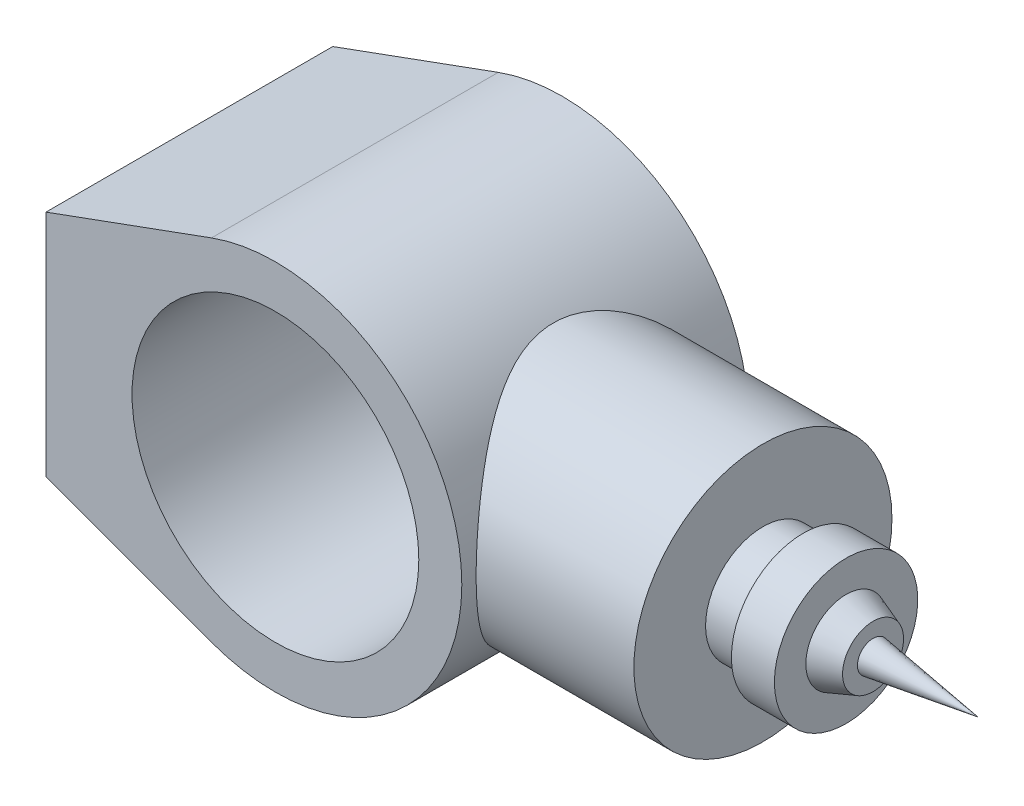
ISO-10303-21;
HEADER;
FILE_DESCRIPTION(('STEP AP214'),'2;1');
FILE_NAME('part.step','',(''),(''),'','','');
FILE_SCHEMA(('AUTOMOTIVE_DESIGN { 1 0 10303 214 1 1 1 1 }'));
ENDSEC;
DATA;
#1=APPLICATION_CONTEXT('core data for automotive mechanical design processes');
#2=APPLICATION_PROTOCOL_DEFINITION('international standard','automotive_design',2000,#1);
#3=PRODUCT_CONTEXT('',#1,'mechanical');
#4=PRODUCT('Part','Part','',(#3));
#5=PRODUCT_RELATED_PRODUCT_CATEGORY('part','',(#4));
#6=PRODUCT_DEFINITION_FORMATION('','',#4);
#7=PRODUCT_DEFINITION_CONTEXT('part definition',#1,'design');
#8=PRODUCT_DEFINITION('design','',#6,#7);
#9=PRODUCT_DEFINITION_SHAPE('','',#8);
#10=(LENGTH_UNIT() NAMED_UNIT(*) SI_UNIT(.MILLI.,.METRE.));
#11=(NAMED_UNIT(*) PLANE_ANGLE_UNIT() SI_UNIT($,.RADIAN.));
#12=(NAMED_UNIT(*) SI_UNIT($,.STERADIAN.) SOLID_ANGLE_UNIT());
#13=UNCERTAINTY_MEASURE_WITH_UNIT(LENGTH_MEASURE(1.E-05),#10,'distance_accuracy_value','');
#14=(GEOMETRIC_REPRESENTATION_CONTEXT(3) GLOBAL_UNCERTAINTY_ASSIGNED_CONTEXT((#13)) GLOBAL_UNIT_ASSIGNED_CONTEXT((#10,
#11,#12)) REPRESENTATION_CONTEXT('',''));
#15=CARTESIAN_POINT('',(0.,0.,0.));
#16=DIRECTION('',(0.,0.,1.));
#17=DIRECTION('',(1.,0.,0.));
#18=AXIS2_PLACEMENT_3D('',#15,#16,#17);
#19=CARTESIAN_POINT('',(0.,0.,100.));
#20=DIRECTION('',(0.,0.,1.));
#21=DIRECTION('',(1.,0.,0.));
#22=AXIS2_PLACEMENT_3D('',#19,#20,#21);
#23=PLANE('',#22);
#24=DIRECTION('',(-0.939410286372225,-0.342794856813887,0.));
#25=VECTOR('',#24,1.);
#26=CARTESIAN_POINT('',(-80.,40.,100.));
#27=LINE('',#26,#25);
#28=CARTESIAN_POINT('',(-22.2816656929027,61.0616686141947,100.));
#29=VERTEX_POINT('',#28);
#30=CARTESIAN_POINT('',(-80.,40.,100.));
#31=VERTEX_POINT('',#30);
#32=EDGE_CURVE('E180',#29,#31,#27,.T.);
#33=ORIENTED_EDGE('',*,*,#32,.T.);
#34=DIRECTION('',(0.,-1.,0.));
#35=VECTOR('',#34,1.);
#36=CARTESIAN_POINT('',(-80.,-40.,100.));
#37=LINE('',#36,#35);
#38=CARTESIAN_POINT('',(-80.,-40.,100.));
#39=VERTEX_POINT('',#38);
#40=EDGE_CURVE('E82',#31,#39,#37,.T.);
#41=ORIENTED_EDGE('',*,*,#40,.T.);
#42=DIRECTION('',(0.939410286372225,-0.342794856813887,0.));
#43=VECTOR('',#42,1.);
#44=CARTESIAN_POINT('',(-80.,-40.,100.));
#45=LINE('',#44,#43);
#46=CARTESIAN_POINT('',(-22.2816656929027,-61.0616686141947,100.));
#47=VERTEX_POINT('',#46);
#48=EDGE_CURVE('E176',#39,#47,#45,.T.);
#49=ORIENTED_EDGE('',*,*,#48,.T.);
#50=CARTESIAN_POINT('',(0.,0.,100.));
#51=DIRECTION('',(0.,0.,1.));
#52=DIRECTION('',(1.,0.,0.));
#53=AXIS2_PLACEMENT_3D('',#50,#51,#52);
#54=CIRCLE('',#53,65.);
#55=EDGE_CURVE('E51',#47,#29,#54,.T.);
#56=ORIENTED_EDGE('',*,*,#55,.T.);
#57=EDGE_LOOP('',(#33,#41,#49,#56));
#58=FACE_BOUND('',#57,.T.);
#59=CARTESIAN_POINT('',(0.,0.,100.));
#60=DIRECTION('',(0.,0.,1.));
#61=DIRECTION('',(1.,0.,0.));
#62=AXIS2_PLACEMENT_3D('',#59,#60,#61);
#63=CIRCLE('',#62,50.);
#64=CARTESIAN_POINT('',(50.,0.,100.));
#65=VERTEX_POINT('',#64);
#66=EDGE_CURVE('E190',#65,#65,#63,.T.);
#67=ORIENTED_EDGE('',*,*,#66,.F.);
#68=EDGE_LOOP('',(#67));
#69=FACE_BOUND('',#68,.T.);
#70=ADVANCED_FACE('F34',(#58,#69),#23,.T.);
#71=CARTESIAN_POINT('',(0.,0.,0.));
#72=DIRECTION('',(0.,0.,1.));
#73=DIRECTION('',(1.,0.,0.));
#74=AXIS2_PLACEMENT_3D('',#71,#72,#73);
#75=PLANE('',#74);
#76=DIRECTION('',(-0.939410286372225,-0.342794856813887,0.));
#77=VECTOR('',#76,1.);
#78=CARTESIAN_POINT('',(-80.,40.,0.));
#79=LINE('',#78,#77);
#80=CARTESIAN_POINT('',(-22.2816656929027,61.0616686141947,0.));
#81=VERTEX_POINT('',#80);
#82=CARTESIAN_POINT('',(-80.,40.,0.));
#83=VERTEX_POINT('',#82);
#84=EDGE_CURVE('E174',#81,#83,#79,.T.);
#85=ORIENTED_EDGE('',*,*,#84,.F.);
#86=CARTESIAN_POINT('',(0.,0.,0.));
#87=DIRECTION('',(0.,0.,1.));
#88=DIRECTION('',(1.,0.,0.));
#89=AXIS2_PLACEMENT_3D('',#86,#87,#88);
#90=CIRCLE('',#89,65.);
#91=CARTESIAN_POINT('',(-22.2816656929027,-61.0616686141947,0.));
#92=VERTEX_POINT('',#91);
#93=EDGE_CURVE('E75',#92,#81,#90,.T.);
#94=ORIENTED_EDGE('',*,*,#93,.F.);
#95=DIRECTION('',(0.939410286372225,-0.342794856813887,0.));
#96=VECTOR('',#95,1.);
#97=CARTESIAN_POINT('',(-80.,-40.,0.));
#98=LINE('',#97,#96);
#99=CARTESIAN_POINT('',(-80.,-40.,0.));
#100=VERTEX_POINT('',#99);
#101=EDGE_CURVE('E69',#100,#92,#98,.T.);
#102=ORIENTED_EDGE('',*,*,#101,.F.);
#103=DIRECTION('',(0.,-1.,0.));
#104=VECTOR('',#103,1.);
#105=CARTESIAN_POINT('',(-80.,-40.,0.));
#106=LINE('',#105,#104);
#107=EDGE_CURVE('E169',#83,#100,#106,.T.);
#108=ORIENTED_EDGE('',*,*,#107,.F.);
#109=EDGE_LOOP('',(#85,#94,#102,#108));
#110=FACE_BOUND('',#109,.T.);
#111=CARTESIAN_POINT('',(0.,0.,0.));
#112=DIRECTION('',(0.,0.,1.));
#113=DIRECTION('',(1.,0.,0.));
#114=AXIS2_PLACEMENT_3D('',#111,#112,#113);
#115=CIRCLE('',#114,50.);
#116=CARTESIAN_POINT('',(50.,0.,0.));
#117=VERTEX_POINT('',#116);
#118=EDGE_CURVE('E192',#117,#117,#115,.T.);
#119=ORIENTED_EDGE('',*,*,#118,.T.);
#120=EDGE_LOOP('',(#119));
#121=FACE_BOUND('',#120,.T.);
#122=ADVANCED_FACE('F149',(#110,#121),#75,.F.);
#123=CARTESIAN_POINT('',(-80.,40.,100.));
#124=DIRECTION('',(0.342794856813887,-0.939410286372225,0.));
#125=DIRECTION('',(0.939410286372225,0.342794856813887,0.));
#126=AXIS2_PLACEMENT_3D('',#123,#124,#125);
#127=PLANE('',#126);
#128=ORIENTED_EDGE('',*,*,#84,.T.);
#129=DIRECTION('',(0.,0.,-1.));
#130=VECTOR('',#129,1.);
#131=CARTESIAN_POINT('',(-80.,40.,100.));
#132=LINE('',#131,#130);
#133=EDGE_CURVE('E11',#31,#83,#132,.T.);
#134=ORIENTED_EDGE('',*,*,#133,.F.);
#135=ORIENTED_EDGE('',*,*,#32,.F.);
#136=DIRECTION('',(0.,0.,-1.));
#137=VECTOR('',#136,1.);
#138=CARTESIAN_POINT('',(-22.2816656929027,61.0616686141947,100.));
#139=LINE('',#138,#137);
#140=EDGE_CURVE('E184',#29,#81,#139,.T.);
#141=ORIENTED_EDGE('',*,*,#140,.T.);
#142=EDGE_LOOP('',(#128,#134,#135,#141));
#143=FACE_BOUND('',#142,.T.);
#144=ADVANCED_FACE('F36',(#143),#127,.F.);
#145=CARTESIAN_POINT('',(-80.,-40.,100.));
#146=DIRECTION('',(1.,0.,0.));
#147=DIRECTION('',(0.,0.,-1.));
#148=AXIS2_PLACEMENT_3D('',#145,#146,#147);
#149=PLANE('',#148);
#150=ORIENTED_EDGE('',*,*,#107,.T.);
#151=DIRECTION('',(0.,0.,-1.));
#152=VECTOR('',#151,1.);
#153=CARTESIAN_POINT('',(-80.,-40.,100.));
#154=LINE('',#153,#152);
#155=EDGE_CURVE('E43',#39,#100,#154,.T.);
#156=ORIENTED_EDGE('',*,*,#155,.F.);
#157=ORIENTED_EDGE('',*,*,#40,.F.);
#158=ORIENTED_EDGE('',*,*,#133,.T.);
#159=EDGE_LOOP('',(#150,#156,#157,#158));
#160=FACE_BOUND('',#159,.T.);
#161=ADVANCED_FACE('F163',(#160),#149,.F.);
#162=CARTESIAN_POINT('',(-80.,-40.,100.));
#163=DIRECTION('',(0.342794856813887,0.939410286372225,0.));
#164=DIRECTION('',(-0.939410286372225,0.342794856813887,0.));
#165=AXIS2_PLACEMENT_3D('',#162,#163,#164);
#166=PLANE('',#165);
#167=ORIENTED_EDGE('',*,*,#101,.T.);
#168=DIRECTION('',(0.,0.,-1.));
#169=VECTOR('',#168,1.);
#170=CARTESIAN_POINT('',(-22.2816656929027,-61.0616686141947,100.));
#171=LINE('',#170,#169);
#172=EDGE_CURVE('E177',#47,#92,#171,.T.);
#173=ORIENTED_EDGE('',*,*,#172,.F.);
#174=ORIENTED_EDGE('',*,*,#48,.F.);
#175=ORIENTED_EDGE('',*,*,#155,.T.);
#176=EDGE_LOOP('',(#167,#173,#174,#175));
#177=FACE_BOUND('',#176,.T.);
#178=ADVANCED_FACE('F160',(#177),#166,.F.);
#179=CARTESIAN_POINT('',(0.,0.,100.));
#180=DIRECTION('',(0.,0.,-1.));
#181=DIRECTION('',(-1.,0.,0.));
#182=AXIS2_PLACEMENT_3D('',#179,#180,#181);
#183=CYLINDRICAL_SURFACE('',#182,65.);
#184=CARTESIAN_POINT('',(65.,0.,5.));
#185=CARTESIAN_POINT('',(65.0000011696057,1.12147330120565,4.99999879747171));
#186=CARTESIAN_POINT('',(64.9709159765212,2.24292945230778,5.04197983975179));
#187=CARTESIAN_POINT('',(64.8553068641383,4.47658414079082,5.20921439063105));
#188=CARTESIAN_POINT('',(64.7687842573088,5.58878288911931,5.33446599646286));
#189=CARTESIAN_POINT('',(64.5403785763001,7.79555151848628,5.66632281203087));
#190=CARTESIAN_POINT('',(64.3984760503456,8.89011506447751,5.87295660687616));
#191=CARTESIAN_POINT('',(64.0626457436966,11.0533096019768,6.36452398659659));
#192=CARTESIAN_POINT('',(63.8687169569864,12.1219400915896,6.64945908556247));
#193=CARTESIAN_POINT('',(63.4342222744662,14.2212125160505,7.29219827029543));
#194=CARTESIAN_POINT('',(63.1938918545645,15.2520162370063,7.6496348748523));
#195=CARTESIAN_POINT('',(62.6709259446924,17.2756280115286,8.43402369131079));
#196=CARTESIAN_POINT('',(62.3882907364915,18.268436318107,8.86097544021119));
#197=CARTESIAN_POINT('',(61.786108553932,20.2116697228795,9.78005800291623));
#198=CARTESIAN_POINT('',(61.4665619062631,21.1620951960855,10.2721882398557));
#199=CARTESIAN_POINT('',(60.7962171584065,23.0172309124314,11.3174352490201));
#200=CARTESIAN_POINT('',(60.4454175300334,23.9219389167185,11.8705550037805));
#201=CARTESIAN_POINT('',(59.6865648974474,25.7601880140228,13.0848262382065));
#202=CARTESIAN_POINT('',(59.27618815402,26.6893215363404,13.7511959994509));
#203=CARTESIAN_POINT('',(58.4330275057249,28.4880338622967,15.1470497940776));
#204=CARTESIAN_POINT('',(58.0002425478181,29.3576098626539,15.8765367946392));
#205=CARTESIAN_POINT('',(57.1195111836477,31.0364486388513,17.3959748647597));
#206=CARTESIAN_POINT('',(56.6715447181891,31.8456267033451,18.1860078205878));
#207=CARTESIAN_POINT('',(55.7691986061138,33.4006700551814,19.8226963443007));
#208=CARTESIAN_POINT('',(55.3148185876119,34.1465316534289,20.6693552063279));
#209=CARTESIAN_POINT('',(54.3303114345595,35.6959084068904,22.5673533840532));
#210=CARTESIAN_POINT('',(53.8005937511269,36.4872853280241,23.6288549343474));
#211=CARTESIAN_POINT('',(52.7593327891933,37.9773509509911,25.82395974361));
#212=CARTESIAN_POINT('',(52.2477941160227,38.6760162868262,26.9575810727483));
#213=CARTESIAN_POINT('',(51.2608149265043,39.9749077721744,29.2927658143072));
#214=CARTESIAN_POINT('',(50.7853275075273,40.5752630453964,30.4942372732033));
#215=CARTESIAN_POINT('',(49.8892399163793,41.6721166930025,32.963068135936));
#216=CARTESIAN_POINT('',(49.4686114171658,42.1686687478853,34.2303930590057));
#217=CARTESIAN_POINT('',(48.8208029416879,42.9149535309565,36.4276003647184));
#218=CARTESIAN_POINT('',(48.5738420263557,43.1936925213245,37.3418791559024));
#219=CARTESIAN_POINT('',(48.1238801744123,43.6944569649788,39.1964610776449));
#220=CARTESIAN_POINT('',(47.9208721021929,43.9164916250901,40.1367599559258));
#221=CARTESIAN_POINT('',(47.5660754926548,44.3005296261305,42.0374956133659));
#222=CARTESIAN_POINT('',(47.4142038087044,44.4626304606427,42.9978969785051));
#223=CARTESIAN_POINT('',(47.1671263845177,44.7246555122386,44.9344594737148));
#224=CARTESIAN_POINT('',(47.0719206259529,44.824579749433,45.9106205986878));
#225=CARTESIAN_POINT('',(46.9418899090943,44.9607388198673,47.8767635152033));
#226=CARTESIAN_POINT('',(46.9073939345417,44.9966266570423,48.8667914815534));
#227=CARTESIAN_POINT('',(46.9013571135476,45.0029190462422,50.8472483770938));
#228=CARTESIAN_POINT('',(46.9298161498631,44.9733237202183,51.837677305534));
#229=CARTESIAN_POINT('',(47.0484302849821,44.8492190899201,53.8112875242908));
#230=CARTESIAN_POINT('',(47.13862305521,44.7546701492421,54.7944640185066));
#231=CARTESIAN_POINT('',(47.3768313176079,44.5024241630868,56.7455149646746));
#232=CARTESIAN_POINT('',(47.5248480621437,44.3447257499009,57.7133890847317));
#233=CARTESIAN_POINT('',(47.8621764271841,43.9803320764262,59.5691936696469));
#234=CARTESIAN_POINT('',(48.0484149088864,43.7772163066585,60.4583970625519));
#235=CARTESIAN_POINT('',(48.4609441046406,43.3201064011899,62.2144143492181));
#236=CARTESIAN_POINT('',(48.6872496045115,43.0660934784814,63.0812198417583));
#237=CARTESIAN_POINT('',(49.1738509640383,42.5096331932465,64.7898225666927));
#238=CARTESIAN_POINT('',(49.4341648638834,42.2071601049958,65.6316062329482));
#239=CARTESIAN_POINT('',(49.9825182796335,41.5563350032134,67.2876417419013));
#240=CARTESIAN_POINT('',(50.2705534011697,41.2079902580444,68.1018979206949));
#241=CARTESIAN_POINT('',(51.0225431471345,40.2767822129268,70.1137766396802));
#242=CARTESIAN_POINT('',(51.5007434523329,39.6654891440572,71.2930273345177));
#243=CARTESIAN_POINT('',(52.4891158781477,38.348029920852,73.5833678403921));
#244=CARTESIAN_POINT('',(52.9993005340588,37.6418264436726,74.6944305853524));
#245=CARTESIAN_POINT('',(54.0361557973494,36.1376496350166,76.8476775780095));
#246=CARTESIAN_POINT('',(54.5628535785461,35.3395185623559,77.8897384505711));
#247=CARTESIAN_POINT('',(55.6171804467178,33.6558443419671,79.8998791095633));
#248=CARTESIAN_POINT('',(56.1448094104418,32.7703120184234,80.8679680307499));
#249=CARTESIAN_POINT('',(57.1932449701135,30.9045304086319,82.7363921475659));
#250=CARTESIAN_POINT('',(57.7139191350983,29.9233731295192,83.6358963165067));
#251=CARTESIAN_POINT('',(58.7296419536465,27.8771206485979,85.3503553497921));
#252=CARTESIAN_POINT('',(59.2246882700661,26.8120178135979,86.1653025097018));
#253=CARTESIAN_POINT('',(60.1756566955639,24.6035209522421,87.7024332048813));
#254=CARTESIAN_POINT('',(60.6316475651595,23.4602711709794,88.4247809320632));
#255=CARTESIAN_POINT('',(61.4931891608211,21.0989507187335,89.7703323765769));
#256=CARTESIAN_POINT('',(61.898755017873,19.8809026570889,90.3935658507715));
#257=CARTESIAN_POINT('',(62.5646802947783,17.6549035875762,91.4059204565395));
#258=CARTESIAN_POINT('',(62.8372982548467,16.6602403417733,91.8163120535009));
#259=CARTESIAN_POINT('',(63.3397164077328,14.6345031625144,92.5675669112335));
#260=CARTESIAN_POINT('',(63.569522535998,13.603434299959,92.9084398107234));
#261=CARTESIAN_POINT('',(63.9815049902596,11.5110112910016,93.5164676119118));
#262=CARTESIAN_POINT('',(64.1637052650743,10.4496726714621,93.7836595836378));
#263=CARTESIAN_POINT('',(64.476639865795,8.3029699318337,94.2409869387356));
#264=CARTESIAN_POINT('',(64.6073730982257,7.21760530180253,94.431120684921));
#265=CARTESIAN_POINT('',(64.8147345736682,5.02649787175021,94.7321113931983));
#266=CARTESIAN_POINT('',(64.8911534961694,3.92069290489761,94.8426616714378));
#267=CARTESIAN_POINT('',(64.9872183357685,1.70145350776205,94.981563734156));
#268=CARTESIAN_POINT('',(65.0068642771874,0.588019080747666,95.0099155538474));
#269=CARTESIAN_POINT('',(64.9889001241945,-1.63741781931568,94.9839662509349));
#270=CARTESIAN_POINT('',(64.9512898349751,-2.74942028747968,94.929664847113));
#271=CARTESIAN_POINT('',(64.819734418053,-4.96298947367603,94.7392747901952));
#272=CARTESIAN_POINT('',(64.7257910494465,-6.06455651648127,94.6031886909653));
#273=CARTESIAN_POINT('',(64.491175703309,-8.18254449212149,94.2620157992034));
#274=CARTESIAN_POINT('',(64.3536808680178,-9.20007959997775,94.0616107864454));
#275=CARTESIAN_POINT('',(64.0337856060908,-11.2121337136589,93.593061351668));
#276=CARTESIAN_POINT('',(63.8513873855499,-12.2066538475799,93.3249202574929));
#277=CARTESIAN_POINT('',(63.4451725249075,-14.1673074608523,92.7239854011605));
#278=CARTESIAN_POINT('',(63.2213525684632,-15.1334386601223,92.3911864622047));
#279=CARTESIAN_POINT('',(62.736336352677,-17.0327019487273,91.6643868113868));
#280=CARTESIAN_POINT('',(62.4751380044848,-17.965832190203,91.2703826790343));
#281=CARTESIAN_POINT('',(61.8990085085122,-19.8637431772395,90.3931275129008));
#282=CARTESIAN_POINT('',(61.58152095285,-20.8256806929253,89.9054081529014));
#283=CARTESIAN_POINT('',(60.9142086391395,-22.7035764997345,88.8677076181211));
#284=CARTESIAN_POINT('',(60.5643826081083,-23.6195329786528,88.3177239921568));
#285=CARTESIAN_POINT('',(59.8381347129401,-25.4032558353403,87.1592008079418));
#286=CARTESIAN_POINT('',(59.4616987975441,-26.270996314329,86.5506302507532));
#287=CARTESIAN_POINT('',(58.6884577670336,-27.9557544991496,85.2787474176625));
#288=CARTESIAN_POINT('',(58.2916515549571,-28.7727694681138,84.6154321925309));
#289=CARTESIAN_POINT('',(57.4151711853793,-30.4889708749912,83.1199200847161));
#290=CARTESIAN_POINT('',(56.9328754552547,-31.3785212006928,82.2781812569548));
#291=CARTESIAN_POINT('',(55.9590893109094,-33.083904221517,80.5278352445589));
#292=CARTESIAN_POINT('',(55.4675975421249,-33.8997259516808,79.6192181500899));
#293=CARTESIAN_POINT('',(54.4860350387396,-35.45586994741,77.7375714933992));
#294=CARTESIAN_POINT('',(53.9959654596117,-36.1961418986443,76.7644997080007));
#295=CARTESIAN_POINT('',(53.0294834997435,-37.5978502361012,74.7568233036382));
#296=CARTESIAN_POINT('',(52.553069328415,-38.2592969946585,73.7222268074148));
#297=CARTESIAN_POINT('',(51.679941347726,-39.4291013564639,71.7149007388747));
#298=CARTESIAN_POINT('',(51.2803372484816,-39.9463152685162,70.7485884228094));
#299=CARTESIAN_POINT('',(50.5123974548912,-40.9130636661729,68.7705314851885));
#300=CARTESIAN_POINT('',(50.1440619804653,-41.3625976757848,67.7587865441704));
#301=CARTESIAN_POINT('',(49.4504928922364,-42.1893301292689,65.693797265063));
#302=CARTESIAN_POINT('',(49.1251906412473,-42.566644202947,64.6406225749502));
#303=CARTESIAN_POINT('',(48.5290098021012,-43.2451098617227,62.4950157035289));
#304=CARTESIAN_POINT('',(48.2581179989952,-43.5462799449171,61.4025931307278));
#305=CARTESIAN_POINT('',(47.8271610412375,-44.0186874861181,59.3921629994351));
#306=CARTESIAN_POINT('',(47.6558419905218,-44.2036946073207,58.4797935357042));
#307=CARTESIAN_POINT('',(47.3627606953031,-44.517583244497,56.6375758266825));
#308=CARTESIAN_POINT('',(47.2409923142224,-44.6464717105955,55.7077297607037));
#309=CARTESIAN_POINT('',(47.05166615705,-44.8459556683364,53.8371873581697));
#310=CARTESIAN_POINT('',(46.9840561376509,-44.9166073394187,52.8965023682052));
#311=CARTESIAN_POINT('',(46.9055698265682,-44.9985645522097,51.0101411651504));
#312=CARTESIAN_POINT('',(46.8946943314281,-45.0098692606967,50.0644648821698));
#313=CARTESIAN_POINT('',(46.9301408777119,-44.972908524549,48.174937986132));
#314=CARTESIAN_POINT('',(46.9764888551696,-44.9246160680299,47.231088395258));
#315=CARTESIAN_POINT('',(47.1245232303033,-44.7693052695385,45.3526810871014));
#316=CARTESIAN_POINT('',(47.226209296244,-44.6622872796083,44.4181233141512));
#317=CARTESIAN_POINT('',(47.4811423262629,-44.3911660407895,42.5633340139344));
#318=CARTESIAN_POINT('',(47.634452919394,-44.2269923369625,41.6431216395032));
#319=CARTESIAN_POINT('',(47.9871889035597,-43.8440109221367,39.8231689356577));
#320=CARTESIAN_POINT('',(48.1866204648689,-43.6251959006593,38.9234313631628));
#321=CARTESIAN_POINT('',(48.6908782922366,-43.0625185245671,36.883273821937));
#322=CARTESIAN_POINT('',(49.0093972350599,-42.7008255731353,35.7511318947817));
#323=CARTESIAN_POINT('',(49.699554494161,-41.8955268796886,33.5331204773627));
#324=CARTESIAN_POINT('',(50.0712093704162,-41.4518955887103,32.4472655500538));
#325=CARTESIAN_POINT('',(50.8544123719762,-40.4872212981013,30.3239670015682));
#326=CARTESIAN_POINT('',(51.2660067549033,-39.9660881554129,29.2865816272362));
#327=CARTESIAN_POINT('',(52.116211879306,-38.8508952329155,27.2636412782135));
#328=CARTESIAN_POINT('',(52.5548209260535,-38.2568400254561,26.2780830593928));
#329=CARTESIAN_POINT('',(53.4579357785502,-36.9847423381263,24.3386713177367));
#330=CARTESIAN_POINT('',(53.9228021101371,-36.3051118639051,23.3860287896923));
#331=CARTESIAN_POINT('',(54.8583333343946,-34.8753950985048,21.5382467159269));
#332=CARTESIAN_POINT('',(55.3289982185488,-34.1253089107936,20.6431070857632));
#333=CARTESIAN_POINT('',(56.2664339133503,-32.5564691651912,18.9123689878534));
#334=CARTESIAN_POINT('',(56.733203509343,-31.7376950080828,18.076788521598));
#335=CARTESIAN_POINT('',(57.6535165855435,-30.033481652025,16.4684810609465));
#336=CARTESIAN_POINT('',(58.1070588196762,-29.1480362003111,15.6957599759879));
#337=CARTESIAN_POINT('',(59.0635284336244,-27.1643113596245,14.0977180537334));
#338=CARTESIAN_POINT('',(59.5626106290919,-26.054747286961,13.2840393836644));
#339=CARTESIAN_POINT('',(60.5176757229357,-23.7521280348398,11.7541358630709));
#340=CARTESIAN_POINT('',(60.9736519283073,-22.5590599397198,11.037926138845));
#341=CARTESIAN_POINT('',(61.6149926579414,-20.7127348127311,10.0441376677902));
#342=CARTESIAN_POINT('',(61.8215919655178,-20.088110583999,9.72641118348023));
#343=CARTESIAN_POINT('',(62.2191547005856,-18.8206694867556,9.11875634511419));
#344=CARTESIAN_POINT('',(62.4101203779565,-18.1778552539997,8.82882399009658));
#345=CARTESIAN_POINT('',(62.7748527233683,-16.875283117665,8.27800686816437));
#346=CARTESIAN_POINT('',(62.9486230408552,-16.2155288469421,8.01711593618761));
#347=CARTESIAN_POINT('',(63.2775356475737,-14.8804011558233,7.52553898807173));
#348=CARTESIAN_POINT('',(63.432679284421,-14.2050288695917,7.29485078669545));
#349=CARTESIAN_POINT('',(63.8070721968101,-12.4447010544915,6.74025505518998));
#350=CARTESIAN_POINT('',(64.0114184468014,-11.3490405228654,6.43972425017143));
#351=CARTESIAN_POINT('',(64.3654191982087,-9.12991345978803,5.92117235560395));
#352=CARTESIAN_POINT('',(64.5150820049425,-8.00645117856258,5.70313873620892));
#353=CARTESIAN_POINT('',(64.7559993187061,-5.74082253729115,5.35298870062844));
#354=CARTESIAN_POINT('',(64.847297757104,-4.59867091062177,5.22080766125575));
#355=CARTESIAN_POINT('',(64.9692976296881,-2.30434018473199,5.04431373617658));
#356=CARTESIAN_POINT('',(64.9999987983895,-1.15216104160191,5.000001235434));
#357=CARTESIAN_POINT('',(65.,0.,5.));
#358=B_SPLINE_CURVE_WITH_KNOTS('',3,(#184,#185,#186,#187,#188,#189,#190,#191,#192,#193,#194,
#195,#196,#197,#198,#199,#200,#201,#202,#203,#204,#205,#206,#207,#208,#209,#210,#211,#212,#213,
#214,#215,#216,#217,#218,#219,#220,#221,#222,#223,#224,#225,#226,#227,#228,#229,#230,#231,#232,
#233,#234,#235,#236,#237,#238,#239,#240,#241,#242,#243,#244,#245,#246,#247,#248,#249,#250,#251,
#252,#253,#254,#255,#256,#257,#258,#259,#260,#261,#262,#263,#264,#265,#266,#267,#268,#269,#270,
#271,#272,#273,#274,#275,#276,#277,#278,#279,#280,#281,#282,#283,#284,#285,#286,#287,#288,#289,
#290,#291,#292,#293,#294,#295,#296,#297,#298,#299,#300,#301,#302,#303,#304,#305,#306,#307,#308,
#309,#310,#311,#312,#313,#314,#315,#316,#317,#318,#319,#320,#321,#322,#323,#324,#325,#326,#327,
#328,#329,#330,#331,#332,#333,#334,#335,#336,#337,#338,#339,#340,#341,#342,#343,#344,#345,#346,
#347,#348,#349,#350,#351,#352,#353,#354,#355,#356,#357),.UNSPECIFIED.,.T.,.F.,(4,2,2,2,2,2,2,2,
2,2,2,2,2,2,2,2,2,2,2,2,2,2,2,2,2,2,2,2,2,2,2,2,2,2,2,2,2,2,2,2,2,2,2,2,2,2,2,2,2,2,2,2,2,2,2,2,
2,2,2,2,2,2,2,2,2,2,2,2,2,2,2,2,2,2,2,2,2,2,2,2,2,2,2,2,2,2,4),(0.,3.36323892794144,
6.72640100710137,10.0907454360665,13.4551549250109,16.8029195613731,20.1506619010729,
23.4983746134034,26.8462511096753,30.4871649037346,34.1282499524345,37.7743494260164,
41.4206611917409,45.6939383064405,49.9682903731881,54.2369825353392,58.5034617073672,
61.4625138492405,64.4210852373372,67.3748225577202,70.3285589227264,73.2982527376573,
76.2679410220408,79.2394430998938,82.2110095388412,85.0011411726389,87.7923045951578,
90.584954683776,93.3771628083065,97.6064034875675,101.837312178738,106.075592113262,
110.313347816192,114.596218662803,118.879479402292,123.155037051935,127.429308626693,
130.755998382163,134.082226580387,137.406778235214,140.731400520075,144.068767009318,
147.406132068879,150.743508483461,154.080780688207,157.215791533369,160.350648386749,
163.485756334407,166.621039552604,169.990545063149,173.360183268584,176.73161428665,
180.103227050672,184.047902440152,187.993163521895,191.94103513809,195.888386692538,
199.385185586645,202.88200907258,206.373186157811,209.863514294626,212.700365177753,
215.536864625513,218.370624567028,221.204424293963,224.039508887241,226.874576485218,
229.713151272815,232.552106037869,236.23803941247,239.925124033801,243.616531168718,
247.307706963636,251.081871120678,254.856029735251,258.631324277359,262.406973327354,
266.792058434817,271.177823293658,273.368885604935,275.55963203795,277.749912517597,
279.940034437727,283.398420446896,286.856280978073,290.31153567335,293.766805506531),.UNSPECIFIED.);
#359=CARTESIAN_POINT('',(65.,0.,5.));
#360=VERTEX_POINT('',#359);
#361=EDGE_CURVE('E115',#360,#360,#358,.T.);
#362=ORIENTED_EDGE('',*,*,#361,.F.);
#363=EDGE_LOOP('',(#362));
#364=FACE_BOUND('',#363,.T.);
#365=ORIENTED_EDGE('',*,*,#93,.T.);
#366=ORIENTED_EDGE('',*,*,#140,.F.);
#367=ORIENTED_EDGE('',*,*,#55,.F.);
#368=ORIENTED_EDGE('',*,*,#172,.T.);
#369=EDGE_LOOP('',(#365,#366,#367,#368));
#370=FACE_BOUND('',#369,.T.);
#371=ADVANCED_FACE('F146',(#364,#370),#183,.T.);
#372=CARTESIAN_POINT('',(0.,0.,100.));
#373=DIRECTION('',(0.,0.,-1.));
#374=DIRECTION('',(-1.,0.,0.));
#375=AXIS2_PLACEMENT_3D('',#372,#373,#374);
#376=CYLINDRICAL_SURFACE('',#375,50.);
#377=ORIENTED_EDGE('',*,*,#66,.T.);
#378=EDGE_LOOP('',(#377));
#379=FACE_BOUND('',#378,.T.);
#380=ORIENTED_EDGE('',*,*,#118,.F.);
#381=EDGE_LOOP('',(#380));
#382=FACE_BOUND('',#381,.T.);
#383=ADVANCED_FACE('F136',(#379,#382),#376,.F.);
#384=CARTESIAN_POINT('',(-80.002,0.,50.));
#385=DIRECTION('',(1.,0.,0.));
#386=DIRECTION('',(0.,0.,-1.));
#387=AXIS2_PLACEMENT_3D('',#384,#385,#386);
#388=CYLINDRICAL_SURFACE('',#387,45.);
#389=CARTESIAN_POINT('',(120.,0.,50.));
#390=DIRECTION('',(1.,0.,0.));
#391=DIRECTION('',(0.,0.,-1.));
#392=AXIS2_PLACEMENT_3D('',#389,#390,#391);
#393=CIRCLE('',#392,45.);
#394=CARTESIAN_POINT('',(120.,0.,5.));
#395=VERTEX_POINT('',#394);
#396=EDGE_CURVE('E123',#395,#395,#393,.T.);
#397=ORIENTED_EDGE('',*,*,#396,.F.);
#398=EDGE_LOOP('',(#397));
#399=FACE_BOUND('',#398,.T.);
#400=ORIENTED_EDGE('',*,*,#361,.T.);
#401=EDGE_LOOP('',(#400));
#402=FACE_BOUND('',#401,.T.);
#403=ADVANCED_FACE('F125',(#399,#402),#388,.T.);
#404=CARTESIAN_POINT('',(120.,0.,50.));
#405=DIRECTION('',(1.,0.,0.));
#406=DIRECTION('',(0.,0.,-1.));
#407=AXIS2_PLACEMENT_3D('',#404,#405,#406);
#408=PLANE('',#407);
#409=CARTESIAN_POINT('',(120.,0.,50.));
#410=DIRECTION('',(-1.,0.,0.));
#411=DIRECTION('',(0.,0.,1.));
#412=AXIS2_PLACEMENT_3D('',#409,#410,#411);
#413=CIRCLE('',#412,20.);
#414=CARTESIAN_POINT('',(120.,0.,70.));
#415=VERTEX_POINT('',#414);
#416=EDGE_CURVE('E112',#415,#415,#413,.T.);
#417=ORIENTED_EDGE('',*,*,#416,.T.);
#418=EDGE_LOOP('',(#417));
#419=FACE_BOUND('',#418,.T.);
#420=ORIENTED_EDGE('',*,*,#396,.T.);
#421=EDGE_LOOP('',(#420));
#422=FACE_BOUND('',#421,.T.);
#423=ADVANCED_FACE('F133',(#419,#422),#408,.T.);
#424=CARTESIAN_POINT('',(-133.942981772862,0.,50.));
#425=DIRECTION('',(-1.,0.,0.));
#426=DIRECTION('',(0.,0.,1.));
#427=AXIS2_PLACEMENT_3D('',#424,#425,#426);
#428=CYLINDRICAL_SURFACE('',#427,20.);
#429=CARTESIAN_POINT('',(134.,0.,50.));
#430=DIRECTION('',(-1.,0.,0.));
#431=DIRECTION('',(0.,0.,1.));
#432=AXIS2_PLACEMENT_3D('',#429,#430,#431);
#433=CIRCLE('',#432,20.);
#434=CARTESIAN_POINT('',(134.,0.,70.));
#435=VERTEX_POINT('',#434);
#436=EDGE_CURVE('E109',#435,#435,#433,.T.);
#437=ORIENTED_EDGE('',*,*,#436,.T.);
#438=EDGE_LOOP('',(#437));
#439=FACE_BOUND('',#438,.T.);
#440=ORIENTED_EDGE('',*,*,#416,.F.);
#441=EDGE_LOOP('',(#440));
#442=FACE_BOUND('',#441,.T.);
#443=ADVANCED_FACE('F131',(#439,#442),#428,.T.);
#444=CARTESIAN_POINT('',(134.,-20.,50.));
#445=DIRECTION('',(-1.,0.,0.));
#446=DIRECTION('',(0.,0.,1.));
#447=AXIS2_PLACEMENT_3D('',#444,#445,#446);
#448=PLANE('',#447);
#449=CARTESIAN_POINT('',(134.,0.,50.));
#450=DIRECTION('',(-1.,0.,0.));
#451=DIRECTION('',(0.,0.,1.));
#452=AXIS2_PLACEMENT_3D('',#449,#450,#451);
#453=CIRCLE('',#452,25.);
#454=CARTESIAN_POINT('',(134.,0.,75.));
#455=VERTEX_POINT('',#454);
#456=EDGE_CURVE('E106',#455,#455,#453,.T.);
#457=ORIENTED_EDGE('',*,*,#456,.T.);
#458=EDGE_LOOP('',(#457));
#459=FACE_BOUND('',#458,.T.);
#460=ORIENTED_EDGE('',*,*,#436,.F.);
#461=EDGE_LOOP('',(#460));
#462=FACE_BOUND('',#461,.T.);
#463=ADVANCED_FACE('F141',(#459,#462),#448,.T.);
#464=CARTESIAN_POINT('',(-133.942981772862,0.,50.));
#465=DIRECTION('',(-1.,0.,0.));
#466=DIRECTION('',(0.,0.,1.));
#467=AXIS2_PLACEMENT_3D('',#464,#465,#466);
#468=CYLINDRICAL_SURFACE('',#467,25.);
#469=CARTESIAN_POINT('',(149.,0.,50.));
#470=DIRECTION('',(-1.,0.,0.));
#471=DIRECTION('',(0.,0.,1.));
#472=AXIS2_PLACEMENT_3D('',#469,#470,#471);
#473=CIRCLE('',#472,25.);
#474=CARTESIAN_POINT('',(149.,0.,75.));
#475=VERTEX_POINT('',#474);
#476=EDGE_CURVE('E103',#475,#475,#473,.T.);
#477=ORIENTED_EDGE('',*,*,#476,.T.);
#478=EDGE_LOOP('',(#477));
#479=FACE_BOUND('',#478,.T.);
#480=ORIENTED_EDGE('',*,*,#456,.F.);
#481=EDGE_LOOP('',(#480));
#482=FACE_BOUND('',#481,.T.);
#483=ADVANCED_FACE('F258',(#479,#482),#468,.T.);
#484=CARTESIAN_POINT('',(149.,-25.,50.));
#485=DIRECTION('',(1.,0.,0.));
#486=DIRECTION('',(0.,0.,-1.));
#487=AXIS2_PLACEMENT_3D('',#484,#485,#486);
#488=PLANE('',#487);
#489=CARTESIAN_POINT('',(149.,0.,50.));
#490=DIRECTION('',(-1.,0.,0.));
#491=DIRECTION('',(0.,0.,1.));
#492=AXIS2_PLACEMENT_3D('',#489,#490,#491);
#493=CIRCLE('',#492,14.0330969997913);
#494=CARTESIAN_POINT('',(149.,0.,64.0330969997913));
#495=VERTEX_POINT('',#494);
#496=EDGE_CURVE('E98',#495,#495,#493,.T.);
#497=ORIENTED_EDGE('',*,*,#496,.T.);
#498=EDGE_LOOP('',(#497));
#499=FACE_BOUND('',#498,.T.);
#500=ORIENTED_EDGE('',*,*,#476,.F.);
#501=EDGE_LOOP('',(#500));
#502=FACE_BOUND('',#501,.T.);
#503=ADVANCED_FACE('F266',(#499,#502),#488,.T.);
#504=CARTESIAN_POINT('',(149.,0.,50.));
#505=DIRECTION('',(-1.,0.,0.));
#506=DIRECTION('',(0.,0.,1.));
#507=AXIS2_PLACEMENT_3D('',#504,#505,#506);
#508=CONICAL_SURFACE('',#507,14.0330969997913,0.347028444550501);
#509=CARTESIAN_POINT('',(158.403875038021,0.,50.));
#510=DIRECTION('',(-1.,0.,0.));
#511=DIRECTION('',(0.,0.,1.));
#512=AXIS2_PLACEMENT_3D('',#509,#510,#511);
#513=CIRCLE('',#512,10.632048004366);
#514=CARTESIAN_POINT('',(158.403875038021,0.,60.632048004366));
#515=VERTEX_POINT('',#514);
#516=EDGE_CURVE('E95',#515,#515,#513,.T.);
#517=ORIENTED_EDGE('',*,*,#516,.T.);
#518=EDGE_LOOP('',(#517));
#519=FACE_BOUND('',#518,.T.);
#520=ORIENTED_EDGE('',*,*,#496,.F.);
#521=EDGE_LOOP('',(#520));
#522=FACE_BOUND('',#521,.T.);
#523=ADVANCED_FACE('F275',(#519,#522),#508,.T.);
#524=CARTESIAN_POINT('',(158.403875038021,-10.632048004366,50.));
#525=DIRECTION('',(1.,0.,0.));
#526=DIRECTION('',(0.,0.,-1.));
#527=AXIS2_PLACEMENT_3D('',#524,#525,#526);
#528=PLANE('',#527);
#529=CARTESIAN_POINT('',(158.403875038021,0.,50.));
#530=DIRECTION('',(-1.,0.,0.));
#531=DIRECTION('',(0.,0.,1.));
#532=AXIS2_PLACEMENT_3D('',#529,#530,#531);
#533=CIRCLE('',#532,5.45193889980671);
#534=CARTESIAN_POINT('',(158.403875038021,0.,55.4519388998067));
#535=VERTEX_POINT('',#534);
#536=EDGE_CURVE('E93',#535,#535,#533,.T.);
#537=ORIENTED_EDGE('',*,*,#536,.T.);
#538=EDGE_LOOP('',(#537));
#539=FACE_BOUND('',#538,.T.);
#540=ORIENTED_EDGE('',*,*,#516,.F.);
#541=EDGE_LOOP('',(#540));
#542=FACE_BOUND('',#541,.T.);
#543=ADVANCED_FACE('F89',(#539,#542),#528,.T.);
#544=CARTESIAN_POINT('',(158.403875038021,0.,50.));
#545=DIRECTION('',(-1.,0.,0.));
#546=DIRECTION('',(0.,0.,1.));
#547=AXIS2_PLACEMENT_3D('',#544,#545,#546);
#548=CONICAL_SURFACE('',#547,5.45193889980671,0.147888185800971);
#549=CARTESIAN_POINT('',(195.,0.,50.));
#550=VERTEX_POINT('',#549);
#551=VERTEX_LOOP('',#550);
#552=FACE_BOUND('',#551,.T.);
#553=ORIENTED_EDGE('',*,*,#536,.F.);
#554=EDGE_LOOP('',(#553));
#555=FACE_BOUND('',#554,.T.);
#556=ADVANCED_FACE('F86',(#552,#555),#548,.T.);
#557=CLOSED_SHELL('',(#70,#122,#144,#161,#178,#371,#383,#403,#423,#443,#463,#483,#503,#523,#543,#556));
#558=MANIFOLD_SOLID_BREP('B2',#557);
#559=ADVANCED_BREP_SHAPE_REPRESENTATION('',(#18,#558),#14);
#560=SHAPE_DEFINITION_REPRESENTATION(#9,#559);
ENDSEC;
END-ISO-10303-21;
